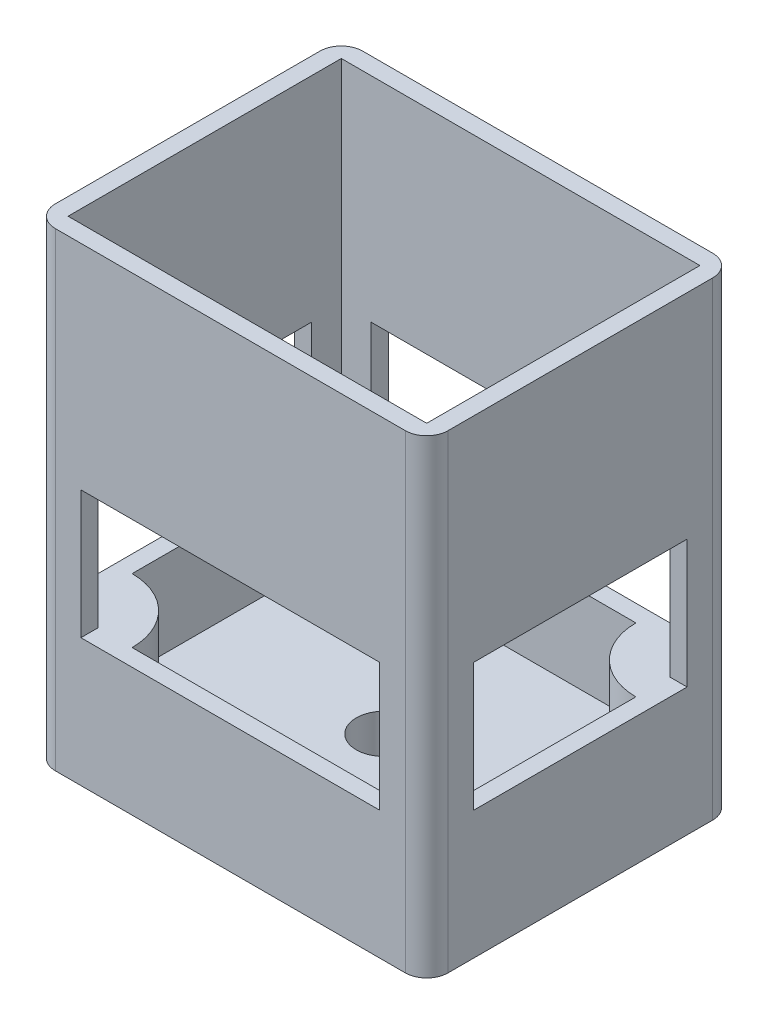
ISO-10303-21;
HEADER;
FILE_DESCRIPTION(('STEP AP214'),'2;1');
FILE_NAME('part.step','',(''),(''),'','','');
FILE_SCHEMA(('AUTOMOTIVE_DESIGN { 1 0 10303 214 1 1 1 1 }'));
ENDSEC;
DATA;
#1=APPLICATION_CONTEXT('core data for automotive mechanical design processes');
#2=APPLICATION_PROTOCOL_DEFINITION('international standard','automotive_design',2000,#1);
#3=PRODUCT_CONTEXT('',#1,'mechanical');
#4=PRODUCT('Part','Part','',(#3));
#5=PRODUCT_RELATED_PRODUCT_CATEGORY('part','',(#4));
#6=PRODUCT_DEFINITION_FORMATION('','',#4);
#7=PRODUCT_DEFINITION_CONTEXT('part definition',#1,'design');
#8=PRODUCT_DEFINITION('design','',#6,#7);
#9=PRODUCT_DEFINITION_SHAPE('','',#8);
#10=(LENGTH_UNIT() NAMED_UNIT(*) SI_UNIT(.MILLI.,.METRE.));
#11=(NAMED_UNIT(*) PLANE_ANGLE_UNIT() SI_UNIT($,.RADIAN.));
#12=(NAMED_UNIT(*) SI_UNIT($,.STERADIAN.) SOLID_ANGLE_UNIT());
#13=UNCERTAINTY_MEASURE_WITH_UNIT(LENGTH_MEASURE(1.E-05),#10,'distance_accuracy_value','');
#14=(GEOMETRIC_REPRESENTATION_CONTEXT(3) GLOBAL_UNCERTAINTY_ASSIGNED_CONTEXT((#13)) GLOBAL_UNIT_ASSIGNED_CONTEXT((#10,
#11,#12)) REPRESENTATION_CONTEXT('',''));
#15=CARTESIAN_POINT('',(0.,0.,0.));
#16=DIRECTION('',(0.,0.,1.));
#17=DIRECTION('',(1.,0.,0.));
#18=AXIS2_PLACEMENT_3D('',#15,#16,#17);
#19=CARTESIAN_POINT('',(21.,55.,-16.));
#20=DIRECTION('',(-1.,0.,0.));
#21=DIRECTION('',(0.,0.,1.));
#22=AXIS2_PLACEMENT_3D('',#19,#20,#21);
#23=PLANE('',#22);
#24=DIRECTION('',(0.,0.,-1.));
#25=VECTOR('',#24,1.);
#26=CARTESIAN_POINT('',(21.,15.,-8.5));
#27=LINE('',#26,#25);
#28=CARTESIAN_POINT('',(21.,15.,-12.5));
#29=VERTEX_POINT('',#28);
#30=CARTESIAN_POINT('',(21.,15.,-16.));
#31=VERTEX_POINT('',#30);
#32=EDGE_CURVE('E376',#29,#31,#27,.T.);
#33=ORIENTED_EDGE('',*,*,#32,.F.);
#34=DIRECTION('',(0.,1.,0.));
#35=VECTOR('',#34,1.);
#36=CARTESIAN_POINT('',(21.,55.,-12.5));
#37=LINE('',#36,#35);
#38=CARTESIAN_POINT('',(21.,30.,-12.5));
#39=VERTEX_POINT('',#38);
#40=EDGE_CURVE('E352',#29,#39,#37,.T.);
#41=ORIENTED_EDGE('',*,*,#40,.T.);
#42=DIRECTION('',(0.,0.,1.));
#43=VECTOR('',#42,1.);
#44=CARTESIAN_POINT('',(21.,30.,-16.));
#45=LINE('',#44,#43);
#46=CARTESIAN_POINT('',(21.,30.,12.5));
#47=VERTEX_POINT('',#46);
#48=EDGE_CURVE('E370',#39,#47,#45,.T.);
#49=ORIENTED_EDGE('',*,*,#48,.T.);
#50=DIRECTION('',(0.,-1.,0.));
#51=VECTOR('',#50,1.);
#52=CARTESIAN_POINT('',(21.,55.,12.5));
#53=LINE('',#52,#51);
#54=CARTESIAN_POINT('',(21.,15.,12.5));
#55=VERTEX_POINT('',#54);
#56=EDGE_CURVE('E364',#47,#55,#53,.T.);
#57=ORIENTED_EDGE('',*,*,#56,.T.);
#58=DIRECTION('',(0.,0.,-1.));
#59=VECTOR('',#58,1.);
#60=CARTESIAN_POINT('',(21.,15.,-16.));
#61=LINE('',#60,#59);
#62=CARTESIAN_POINT('',(21.,15.,-8.5));
#63=VERTEX_POINT('',#62);
#64=EDGE_CURVE('E356',#55,#63,#61,.T.);
#65=ORIENTED_EDGE('',*,*,#64,.T.);
#66=DIRECTION('',(0.,-1.,0.));
#67=VECTOR('',#66,1.);
#68=CARTESIAN_POINT('',(21.,15.,-8.5));
#69=LINE('',#68,#67);
#70=CARTESIAN_POINT('',(21.,5.,-8.5));
#71=VERTEX_POINT('',#70);
#72=EDGE_CURVE('E385',#63,#71,#69,.T.);
#73=ORIENTED_EDGE('',*,*,#72,.T.);
#74=DIRECTION('',(0.,0.,1.));
#75=VECTOR('',#74,1.);
#76=CARTESIAN_POINT('',(21.,5.,-16.));
#77=LINE('',#76,#75);
#78=CARTESIAN_POINT('',(21.,5.,16.));
#79=VERTEX_POINT('',#78);
#80=EDGE_CURVE('E406',#71,#79,#77,.T.);
#81=ORIENTED_EDGE('',*,*,#80,.T.);
#82=DIRECTION('',(0.,-1.,0.));
#83=VECTOR('',#82,1.);
#84=CARTESIAN_POINT('',(21.,55.,16.));
#85=LINE('',#84,#83);
#86=CARTESIAN_POINT('',(21.,55.,16.));
#87=VERTEX_POINT('',#86);
#88=EDGE_CURVE('E428',#87,#79,#85,.T.);
#89=ORIENTED_EDGE('',*,*,#88,.F.);
#90=DIRECTION('',(0.,0.,-1.));
#91=VECTOR('',#90,1.);
#92=CARTESIAN_POINT('',(21.,55.,-16.));
#93=LINE('',#92,#91);
#94=CARTESIAN_POINT('',(21.,55.,-16.));
#95=VERTEX_POINT('',#94);
#96=EDGE_CURVE('E417',#87,#95,#93,.T.);
#97=ORIENTED_EDGE('',*,*,#96,.T.);
#98=DIRECTION('',(0.,-1.,0.));
#99=VECTOR('',#98,1.);
#100=CARTESIAN_POINT('',(21.,55.,-16.));
#101=LINE('',#100,#99);
#102=EDGE_CURVE('E425',#95,#31,#101,.T.);
#103=ORIENTED_EDGE('',*,*,#102,.T.);
#104=EDGE_LOOP('',(#33,#41,#49,#57,#65,#73,#81,#89,#97,#103));
#105=FACE_BOUND('',#104,.T.);
#106=ADVANCED_FACE('F40',(#105),#23,.T.);
#107=CARTESIAN_POINT('',(-21.,55.,-16.));
#108=DIRECTION('',(1.,0.,0.));
#109=DIRECTION('',(0.,0.,-1.));
#110=AXIS2_PLACEMENT_3D('',#107,#108,#109);
#111=PLANE('',#110);
#112=DIRECTION('',(0.,-1.,0.));
#113=VECTOR('',#112,1.);
#114=CARTESIAN_POINT('',(-21.,55.,-12.5));
#115=LINE('',#114,#113);
#116=CARTESIAN_POINT('',(-21.,30.,-12.5));
#117=VERTEX_POINT('',#116);
#118=CARTESIAN_POINT('',(-21.,15.,-12.5));
#119=VERTEX_POINT('',#118);
#120=EDGE_CURVE('E349',#117,#119,#115,.T.);
#121=ORIENTED_EDGE('',*,*,#120,.T.);
#122=DIRECTION('',(0.,0.,1.));
#123=VECTOR('',#122,1.);
#124=CARTESIAN_POINT('',(-21.,15.,-16.));
#125=LINE('',#124,#123);
#126=CARTESIAN_POINT('',(-21.,15.,8.5));
#127=VERTEX_POINT('',#126);
#128=EDGE_CURVE('E355',#119,#127,#125,.T.);
#129=ORIENTED_EDGE('',*,*,#128,.T.);
#130=DIRECTION('',(0.,-1.,0.));
#131=VECTOR('',#130,1.);
#132=CARTESIAN_POINT('',(-21.,15.,8.5));
#133=LINE('',#132,#131);
#134=CARTESIAN_POINT('',(-21.,5.,8.5));
#135=VERTEX_POINT('',#134);
#136=EDGE_CURVE('E400',#127,#135,#133,.T.);
#137=ORIENTED_EDGE('',*,*,#136,.T.);
#138=DIRECTION('',(0.,0.,-1.));
#139=VECTOR('',#138,1.);
#140=CARTESIAN_POINT('',(-21.,5.,16.));
#141=LINE('',#140,#139);
#142=CARTESIAN_POINT('',(-21.,5.,-16.));
#143=VERTEX_POINT('',#142);
#144=EDGE_CURVE('E411',#135,#143,#141,.T.);
#145=ORIENTED_EDGE('',*,*,#144,.T.);
#146=DIRECTION('',(0.,-1.,0.));
#147=VECTOR('',#146,1.);
#148=CARTESIAN_POINT('',(-21.,55.,-16.));
#149=LINE('',#148,#147);
#150=CARTESIAN_POINT('',(-21.,55.,-16.));
#151=VERTEX_POINT('',#150);
#152=EDGE_CURVE('E422',#151,#143,#149,.T.);
#153=ORIENTED_EDGE('',*,*,#152,.F.);
#154=DIRECTION('',(0.,0.,1.));
#155=VECTOR('',#154,1.);
#156=CARTESIAN_POINT('',(-21.,55.,-16.));
#157=LINE('',#156,#155);
#158=CARTESIAN_POINT('',(-21.,55.,16.));
#159=VERTEX_POINT('',#158);
#160=EDGE_CURVE('E413',#151,#159,#157,.T.);
#161=ORIENTED_EDGE('',*,*,#160,.T.);
#162=DIRECTION('',(0.,-1.,0.));
#163=VECTOR('',#162,1.);
#164=CARTESIAN_POINT('',(-21.,55.,16.));
#165=LINE('',#164,#163);
#166=CARTESIAN_POINT('',(-21.,15.,16.));
#167=VERTEX_POINT('',#166);
#168=EDGE_CURVE('E431',#159,#167,#165,.T.);
#169=ORIENTED_EDGE('',*,*,#168,.T.);
#170=DIRECTION('',(0.,0.,1.));
#171=VECTOR('',#170,1.);
#172=CARTESIAN_POINT('',(-21.,15.,8.5));
#173=LINE('',#172,#171);
#174=CARTESIAN_POINT('',(-21.,15.,12.5));
#175=VERTEX_POINT('',#174);
#176=EDGE_CURVE('E390',#175,#167,#173,.T.);
#177=ORIENTED_EDGE('',*,*,#176,.F.);
#178=DIRECTION('',(0.,1.,0.));
#179=VECTOR('',#178,1.);
#180=CARTESIAN_POINT('',(-21.,55.,12.5));
#181=LINE('',#180,#179);
#182=CARTESIAN_POINT('',(-21.,30.,12.5));
#183=VERTEX_POINT('',#182);
#184=EDGE_CURVE('E359',#175,#183,#181,.T.);
#185=ORIENTED_EDGE('',*,*,#184,.T.);
#186=DIRECTION('',(0.,0.,-1.));
#187=VECTOR('',#186,1.);
#188=CARTESIAN_POINT('',(-21.,30.,-16.));
#189=LINE('',#188,#187);
#190=EDGE_CURVE('E367',#183,#117,#189,.T.);
#191=ORIENTED_EDGE('',*,*,#190,.T.);
#192=EDGE_LOOP('',(#121,#129,#137,#145,#153,#161,#169,#177,#185,#191));
#193=FACE_BOUND('',#192,.T.);
#194=ADVANCED_FACE('F539',(#193),#111,.T.);
#195=CARTESIAN_POINT('',(-23.,55.,-18.));
#196=DIRECTION('',(1.,0.,0.));
#197=DIRECTION('',(0.,0.,-1.));
#198=AXIS2_PLACEMENT_3D('',#195,#196,#197);
#199=PLANE('',#198);
#200=DIRECTION('',(0.,0.,1.));
#201=VECTOR('',#200,1.);
#202=CARTESIAN_POINT('',(-23.,55.,-18.));
#203=LINE('',#202,#201);
#204=CARTESIAN_POINT('',(-23.,55.,-15.5));
#205=VERTEX_POINT('',#204);
#206=CARTESIAN_POINT('',(-23.,55.,15.5));
#207=VERTEX_POINT('',#206);
#208=EDGE_CURVE('E435',#205,#207,#203,.T.);
#209=ORIENTED_EDGE('',*,*,#208,.F.);
#210=DIRECTION('',(0.,-1.,0.));
#211=VECTOR('',#210,1.);
#212=CARTESIAN_POINT('',(-23.,55.,-15.5));
#213=LINE('',#212,#211);
#214=CARTESIAN_POINT('',(-23.,0.,-15.5));
#215=VERTEX_POINT('',#214);
#216=EDGE_CURVE('E460',#205,#215,#213,.T.);
#217=ORIENTED_EDGE('',*,*,#216,.T.);
#218=DIRECTION('',(0.,0.,1.));
#219=VECTOR('',#218,1.);
#220=CARTESIAN_POINT('',(-23.,0.,-18.));
#221=LINE('',#220,#219);
#222=CARTESIAN_POINT('',(-23.,0.,15.5));
#223=VERTEX_POINT('',#222);
#224=EDGE_CURVE('E434',#215,#223,#221,.T.);
#225=ORIENTED_EDGE('',*,*,#224,.T.);
#226=DIRECTION('',(0.,-1.,0.));
#227=VECTOR('',#226,1.);
#228=CARTESIAN_POINT('',(-23.,55.,15.5));
#229=LINE('',#228,#227);
#230=EDGE_CURVE('E448',#223,#207,#229,.F.);
#231=ORIENTED_EDGE('',*,*,#230,.T.);
#232=EDGE_LOOP('',(#209,#217,#225,#231));
#233=FACE_BOUND('',#232,.T.);
#234=DIRECTION('',(0.,-1.,0.));
#235=VECTOR('',#234,1.);
#236=CARTESIAN_POINT('',(-23.,30.,-12.5));
#237=LINE('',#236,#235);
#238=CARTESIAN_POINT('',(-23.,30.,-12.5));
#239=VERTEX_POINT('',#238);
#240=CARTESIAN_POINT('',(-23.,15.,-12.5));
#241=VERTEX_POINT('',#240);
#242=EDGE_CURVE('E314',#239,#241,#237,.T.);
#243=ORIENTED_EDGE('',*,*,#242,.F.);
#244=DIRECTION('',(0.,0.,-1.));
#245=VECTOR('',#244,1.);
#246=CARTESIAN_POINT('',(-23.,30.,-12.5));
#247=LINE('',#246,#245);
#248=CARTESIAN_POINT('',(-23.,30.,12.5));
#249=VERTEX_POINT('',#248);
#250=EDGE_CURVE('E322',#249,#239,#247,.T.);
#251=ORIENTED_EDGE('',*,*,#250,.F.);
#252=DIRECTION('',(0.,1.,0.));
#253=VECTOR('',#252,1.);
#254=CARTESIAN_POINT('',(-23.,30.,12.5));
#255=LINE('',#254,#253);
#256=CARTESIAN_POINT('',(-23.,15.,12.5));
#257=VERTEX_POINT('',#256);
#258=EDGE_CURVE('E319',#257,#249,#255,.T.);
#259=ORIENTED_EDGE('',*,*,#258,.F.);
#260=DIRECTION('',(0.,0.,1.));
#261=VECTOR('',#260,1.);
#262=CARTESIAN_POINT('',(-23.,15.,-12.5));
#263=LINE('',#262,#261);
#264=EDGE_CURVE('E316',#241,#257,#263,.T.);
#265=ORIENTED_EDGE('',*,*,#264,.F.);
#266=EDGE_LOOP('',(#243,#251,#259,#265));
#267=FACE_BOUND('',#266,.T.);
#268=ADVANCED_FACE('F526',(#233,#267),#199,.F.);
#269=CARTESIAN_POINT('',(23.,55.,-18.));
#270=DIRECTION('',(-1.,0.,0.));
#271=DIRECTION('',(0.,0.,1.));
#272=AXIS2_PLACEMENT_3D('',#269,#270,#271);
#273=PLANE('',#272);
#274=DIRECTION('',(0.,0.,-1.));
#275=VECTOR('',#274,1.);
#276=CARTESIAN_POINT('',(23.,0.,-18.));
#277=LINE('',#276,#275);
#278=CARTESIAN_POINT('',(23.,0.,15.5));
#279=VERTEX_POINT('',#278);
#280=CARTESIAN_POINT('',(23.,0.,-15.5));
#281=VERTEX_POINT('',#280);
#282=EDGE_CURVE('E454',#279,#281,#277,.T.);
#283=ORIENTED_EDGE('',*,*,#282,.T.);
#284=DIRECTION('',(0.,-1.,0.));
#285=VECTOR('',#284,1.);
#286=CARTESIAN_POINT('',(23.,55.,-15.5));
#287=LINE('',#286,#285);
#288=CARTESIAN_POINT('',(23.,55.,-15.5));
#289=VERTEX_POINT('',#288);
#290=EDGE_CURVE('E487',#281,#289,#287,.F.);
#291=ORIENTED_EDGE('',*,*,#290,.T.);
#292=DIRECTION('',(0.,0.,-1.));
#293=VECTOR('',#292,1.);
#294=CARTESIAN_POINT('',(23.,55.,-18.));
#295=LINE('',#294,#293);
#296=CARTESIAN_POINT('',(23.,55.,15.5));
#297=VERTEX_POINT('',#296);
#298=EDGE_CURVE('E442',#297,#289,#295,.T.);
#299=ORIENTED_EDGE('',*,*,#298,.F.);
#300=DIRECTION('',(0.,-1.,0.));
#301=VECTOR('',#300,1.);
#302=CARTESIAN_POINT('',(23.,55.,15.5));
#303=LINE('',#302,#301);
#304=EDGE_CURVE('E484',#297,#279,#303,.T.);
#305=ORIENTED_EDGE('',*,*,#304,.T.);
#306=EDGE_LOOP('',(#283,#291,#299,#305));
#307=FACE_BOUND('',#306,.T.);
#308=DIRECTION('',(0.,-1.,0.));
#309=VECTOR('',#308,1.);
#310=CARTESIAN_POINT('',(23.,30.,-12.5));
#311=LINE('',#310,#309);
#312=CARTESIAN_POINT('',(23.,30.,-12.5));
#313=VERTEX_POINT('',#312);
#314=CARTESIAN_POINT('',(23.,15.,-12.5));
#315=VERTEX_POINT('',#314);
#316=EDGE_CURVE('E313',#313,#315,#311,.T.);
#317=ORIENTED_EDGE('',*,*,#316,.T.);
#318=DIRECTION('',(0.,0.,1.));
#319=VECTOR('',#318,1.);
#320=CARTESIAN_POINT('',(23.,15.,-12.5));
#321=LINE('',#320,#319);
#322=CARTESIAN_POINT('',(23.,15.,12.5));
#323=VERTEX_POINT('',#322);
#324=EDGE_CURVE('E327',#315,#323,#321,.T.);
#325=ORIENTED_EDGE('',*,*,#324,.T.);
#326=DIRECTION('',(0.,1.,0.));
#327=VECTOR('',#326,1.);
#328=CARTESIAN_POINT('',(23.,30.,12.5));
#329=LINE('',#328,#327);
#330=CARTESIAN_POINT('',(23.,30.,12.5));
#331=VERTEX_POINT('',#330);
#332=EDGE_CURVE('E330',#323,#331,#329,.T.);
#333=ORIENTED_EDGE('',*,*,#332,.T.);
#334=DIRECTION('',(0.,0.,-1.));
#335=VECTOR('',#334,1.);
#336=CARTESIAN_POINT('',(23.,30.,-12.5));
#337=LINE('',#336,#335);
#338=EDGE_CURVE('E317',#331,#313,#337,.T.);
#339=ORIENTED_EDGE('',*,*,#338,.T.);
#340=EDGE_LOOP('',(#317,#325,#333,#339));
#341=FACE_BOUND('',#340,.T.);
#342=ADVANCED_FACE('F507',(#307,#341),#273,.F.);
#343=CARTESIAN_POINT('',(0.,5.,0.));
#344=DIRECTION('',(0.,-1.,0.));
#345=DIRECTION('',(0.,0.,-1.));
#346=AXIS2_PLACEMENT_3D('',#343,#344,#345);
#347=PLANE('',#346);
#348=CARTESIAN_POINT('',(0.,5.,0.));
#349=DIRECTION('',(0.,1.,0.));
#350=DIRECTION('',(0.,0.,1.));
#351=AXIS2_PLACEMENT_3D('',#348,#349,#350);
#352=CIRCLE('',#351,3.25);
#353=CARTESIAN_POINT('',(0.,5.,3.25));
#354=VERTEX_POINT('',#353);
#355=EDGE_CURVE('E814',#354,#354,#352,.T.);
#356=ORIENTED_EDGE('',*,*,#355,.F.);
#357=EDGE_LOOP('',(#356));
#358=FACE_BOUND('',#357,.T.);
#359=CARTESIAN_POINT('',(21.,5.,-16.));
#360=DIRECTION('',(0.,1.,0.));
#361=DIRECTION('',(0.,0.,1.));
#362=AXIS2_PLACEMENT_3D('',#359,#360,#361);
#363=CIRCLE('',#362,7.5);
#364=CARTESIAN_POINT('',(13.5,5.,-16.));
#365=VERTEX_POINT('',#364);
#366=EDGE_CURVE('E373',#365,#71,#363,.T.);
#367=ORIENTED_EDGE('',*,*,#366,.F.);
#368=DIRECTION('',(1.,0.,0.));
#369=VECTOR('',#368,1.);
#370=CARTESIAN_POINT('',(-21.,5.,-16.));
#371=LINE('',#370,#369);
#372=EDGE_CURVE('E403',#143,#365,#371,.T.);
#373=ORIENTED_EDGE('',*,*,#372,.F.);
#374=ORIENTED_EDGE('',*,*,#144,.F.);
#375=CARTESIAN_POINT('',(-21.,5.,16.));
#376=DIRECTION('',(0.,1.,0.));
#377=DIRECTION('',(0.,0.,1.));
#378=AXIS2_PLACEMENT_3D('',#375,#376,#377);
#379=CIRCLE('',#378,7.5);
#380=CARTESIAN_POINT('',(-13.5,5.,16.));
#381=VERTEX_POINT('',#380);
#382=EDGE_CURVE('E387',#381,#135,#379,.T.);
#383=ORIENTED_EDGE('',*,*,#382,.F.);
#384=DIRECTION('',(-1.,0.,0.));
#385=VECTOR('',#384,1.);
#386=CARTESIAN_POINT('',(21.,5.,16.));
#387=LINE('',#386,#385);
#388=EDGE_CURVE('E408',#79,#381,#387,.T.);
#389=ORIENTED_EDGE('',*,*,#388,.F.);
#390=ORIENTED_EDGE('',*,*,#80,.F.);
#391=EDGE_LOOP('',(#367,#373,#374,#383,#389,#390));
#392=FACE_BOUND('',#391,.T.);
#393=ADVANCED_FACE('F565',(#358,#392),#347,.F.);
#394=CARTESIAN_POINT('',(-21.,55.,-16.));
#395=DIRECTION('',(0.,0.,1.));
#396=DIRECTION('',(1.,0.,0.));
#397=AXIS2_PLACEMENT_3D('',#394,#395,#396);
#398=PLANE('',#397);
#399=DIRECTION('',(0.,1.,0.));
#400=VECTOR('',#399,1.);
#401=CARTESIAN_POINT('',(17.5,55.,-16.));
#402=LINE('',#401,#400);
#403=CARTESIAN_POINT('',(17.5,15.,-16.));
#404=VERTEX_POINT('',#403);
#405=CARTESIAN_POINT('',(17.5,30.,-16.));
#406=VERTEX_POINT('',#405);
#407=EDGE_CURVE('E300',#404,#406,#402,.T.);
#408=ORIENTED_EDGE('',*,*,#407,.F.);
#409=DIRECTION('',(-1.,0.,0.));
#410=VECTOR('',#409,1.);
#411=CARTESIAN_POINT('',(21.,15.,-16.));
#412=LINE('',#411,#410);
#413=EDGE_CURVE('E378',#31,#404,#412,.T.);
#414=ORIENTED_EDGE('',*,*,#413,.F.);
#415=ORIENTED_EDGE('',*,*,#102,.F.);
#416=DIRECTION('',(-1.,0.,0.));
#417=VECTOR('',#416,1.);
#418=CARTESIAN_POINT('',(-21.,55.,-16.));
#419=LINE('',#418,#417);
#420=EDGE_CURVE('E420',#95,#151,#419,.T.);
#421=ORIENTED_EDGE('',*,*,#420,.T.);
#422=ORIENTED_EDGE('',*,*,#152,.T.);
#423=ORIENTED_EDGE('',*,*,#372,.T.);
#424=DIRECTION('',(0.,-1.,0.));
#425=VECTOR('',#424,1.);
#426=CARTESIAN_POINT('',(13.5,15.,-16.));
#427=LINE('',#426,#425);
#428=CARTESIAN_POINT('',(13.5,15.,-16.));
#429=VERTEX_POINT('',#428);
#430=EDGE_CURVE('E380',#429,#365,#427,.T.);
#431=ORIENTED_EDGE('',*,*,#430,.F.);
#432=DIRECTION('',(1.,0.,0.));
#433=VECTOR('',#432,1.);
#434=CARTESIAN_POINT('',(-21.,15.,-16.));
#435=LINE('',#434,#433);
#436=CARTESIAN_POINT('',(-17.5,15.,-16.));
#437=VERTEX_POINT('',#436);
#438=EDGE_CURVE('E303',#437,#429,#435,.T.);
#439=ORIENTED_EDGE('',*,*,#438,.F.);
#440=DIRECTION('',(0.,-1.,0.));
#441=VECTOR('',#440,1.);
#442=CARTESIAN_POINT('',(-17.5,55.,-16.));
#443=LINE('',#442,#441);
#444=CARTESIAN_POINT('',(-17.5,30.,-16.));
#445=VERTEX_POINT('',#444);
#446=EDGE_CURVE('E256',#445,#437,#443,.T.);
#447=ORIENTED_EDGE('',*,*,#446,.F.);
#448=DIRECTION('',(-1.,0.,0.));
#449=VECTOR('',#448,1.);
#450=CARTESIAN_POINT('',(-21.,30.,-16.));
#451=LINE('',#450,#449);
#452=EDGE_CURVE('E311',#406,#445,#451,.T.);
#453=ORIENTED_EDGE('',*,*,#452,.F.);
#454=EDGE_LOOP('',(#408,#414,#415,#421,#422,#423,#431,#439,#447,#453));
#455=FACE_BOUND('',#454,.T.);
#456=ADVANCED_FACE('F550',(#455),#398,.T.);
#457=CARTESIAN_POINT('',(-21.,55.,16.));
#458=DIRECTION('',(0.,0.,-1.));
#459=DIRECTION('',(-1.,0.,0.));
#460=AXIS2_PLACEMENT_3D('',#457,#458,#459);
#461=PLANE('',#460);
#462=DIRECTION('',(0.,1.,0.));
#463=VECTOR('',#462,1.);
#464=CARTESIAN_POINT('',(-17.5,55.,16.));
#465=LINE('',#464,#463);
#466=CARTESIAN_POINT('',(-17.5,15.,16.));
#467=VERTEX_POINT('',#466);
#468=CARTESIAN_POINT('',(-17.5,30.,16.));
#469=VERTEX_POINT('',#468);
#470=EDGE_CURVE('E305',#467,#469,#465,.T.);
#471=ORIENTED_EDGE('',*,*,#470,.F.);
#472=DIRECTION('',(1.,0.,0.));
#473=VECTOR('',#472,1.);
#474=CARTESIAN_POINT('',(-21.,15.,16.));
#475=LINE('',#474,#473);
#476=EDGE_CURVE('E392',#167,#467,#475,.T.);
#477=ORIENTED_EDGE('',*,*,#476,.F.);
#478=ORIENTED_EDGE('',*,*,#168,.F.);
#479=DIRECTION('',(1.,0.,0.));
#480=VECTOR('',#479,1.);
#481=CARTESIAN_POINT('',(-21.,55.,16.));
#482=LINE('',#481,#480);
#483=EDGE_CURVE('E415',#159,#87,#482,.T.);
#484=ORIENTED_EDGE('',*,*,#483,.T.);
#485=ORIENTED_EDGE('',*,*,#88,.T.);
#486=ORIENTED_EDGE('',*,*,#388,.T.);
#487=DIRECTION('',(0.,-1.,0.));
#488=VECTOR('',#487,1.);
#489=CARTESIAN_POINT('',(-13.5,15.,16.));
#490=LINE('',#489,#488);
#491=CARTESIAN_POINT('',(-13.5,15.,16.));
#492=VERTEX_POINT('',#491);
#493=EDGE_CURVE('E395',#492,#381,#490,.T.);
#494=ORIENTED_EDGE('',*,*,#493,.F.);
#495=DIRECTION('',(-1.,0.,0.));
#496=VECTOR('',#495,1.);
#497=CARTESIAN_POINT('',(-21.,15.,16.));
#498=LINE('',#497,#496);
#499=CARTESIAN_POINT('',(17.5,15.,16.));
#500=VERTEX_POINT('',#499);
#501=EDGE_CURVE('E302',#500,#492,#498,.T.);
#502=ORIENTED_EDGE('',*,*,#501,.F.);
#503=DIRECTION('',(0.,-1.,0.));
#504=VECTOR('',#503,1.);
#505=CARTESIAN_POINT('',(17.5,55.,16.));
#506=LINE('',#505,#504);
#507=CARTESIAN_POINT('',(17.5,30.,16.));
#508=VERTEX_POINT('',#507);
#509=EDGE_CURVE('E292',#508,#500,#506,.T.);
#510=ORIENTED_EDGE('',*,*,#509,.F.);
#511=DIRECTION('',(1.,0.,0.));
#512=VECTOR('',#511,1.);
#513=CARTESIAN_POINT('',(-21.,30.,16.));
#514=LINE('',#513,#512);
#515=EDGE_CURVE('E309',#469,#508,#514,.T.);
#516=ORIENTED_EDGE('',*,*,#515,.F.);
#517=EDGE_LOOP('',(#471,#477,#478,#484,#485,#486,#494,#502,#510,#516));
#518=FACE_BOUND('',#517,.T.);
#519=ADVANCED_FACE('F552',(#518),#461,.T.);
#520=CARTESIAN_POINT('',(0.,55.,0.));
#521=DIRECTION('',(0.,1.,0.));
#522=DIRECTION('',(0.,0.,1.));
#523=AXIS2_PLACEMENT_3D('',#520,#521,#522);
#524=PLANE('',#523);
#525=DIRECTION('',(-1.,0.,0.));
#526=VECTOR('',#525,1.);
#527=CARTESIAN_POINT('',(-23.,55.,-18.));
#528=LINE('',#527,#526);
#529=CARTESIAN_POINT('',(20.5,55.,-18.));
#530=VERTEX_POINT('',#529);
#531=CARTESIAN_POINT('',(-20.5,55.,-18.));
#532=VERTEX_POINT('',#531);
#533=EDGE_CURVE('E445',#530,#532,#528,.T.);
#534=ORIENTED_EDGE('',*,*,#533,.T.);
#535=CARTESIAN_POINT('',(-20.5,55.,-15.5));
#536=DIRECTION('',(0.,1.,0.));
#537=DIRECTION('',(0.,0.,1.));
#538=AXIS2_PLACEMENT_3D('',#535,#536,#537);
#539=CIRCLE('',#538,2.5);
#540=EDGE_CURVE('E482',#532,#205,#539,.T.);
#541=ORIENTED_EDGE('',*,*,#540,.T.);
#542=ORIENTED_EDGE('',*,*,#208,.T.);
#543=CARTESIAN_POINT('',(-20.5,55.,15.5));
#544=DIRECTION('',(0.,1.,0.));
#545=DIRECTION('',(0.,0.,1.));
#546=AXIS2_PLACEMENT_3D('',#543,#544,#545);
#547=CIRCLE('',#546,2.5);
#548=CARTESIAN_POINT('',(-20.5,55.,18.));
#549=VERTEX_POINT('',#548);
#550=EDGE_CURVE('E476',#207,#549,#547,.T.);
#551=ORIENTED_EDGE('',*,*,#550,.T.);
#552=DIRECTION('',(1.,0.,0.));
#553=VECTOR('',#552,1.);
#554=CARTESIAN_POINT('',(-23.,55.,18.));
#555=LINE('',#554,#553);
#556=CARTESIAN_POINT('',(20.5,55.,18.));
#557=VERTEX_POINT('',#556);
#558=EDGE_CURVE('E438',#549,#557,#555,.T.);
#559=ORIENTED_EDGE('',*,*,#558,.T.);
#560=CARTESIAN_POINT('',(20.5,55.,15.5));
#561=DIRECTION('',(0.,1.,0.));
#562=DIRECTION('',(0.,0.,1.));
#563=AXIS2_PLACEMENT_3D('',#560,#561,#562);
#564=CIRCLE('',#563,2.5);
#565=EDGE_CURVE('E478',#557,#297,#564,.T.);
#566=ORIENTED_EDGE('',*,*,#565,.T.);
#567=ORIENTED_EDGE('',*,*,#298,.T.);
#568=CARTESIAN_POINT('',(20.5,55.,-15.5));
#569=DIRECTION('',(0.,1.,0.));
#570=DIRECTION('',(0.,0.,1.));
#571=AXIS2_PLACEMENT_3D('',#568,#569,#570);
#572=CIRCLE('',#571,2.5);
#573=EDGE_CURVE('E480',#289,#530,#572,.T.);
#574=ORIENTED_EDGE('',*,*,#573,.T.);
#575=EDGE_LOOP('',(#534,#541,#542,#551,#559,#566,#567,#574));
#576=FACE_BOUND('',#575,.T.);
#577=ORIENTED_EDGE('',*,*,#483,.F.);
#578=ORIENTED_EDGE('',*,*,#160,.F.);
#579=ORIENTED_EDGE('',*,*,#420,.F.);
#580=ORIENTED_EDGE('',*,*,#96,.F.);
#581=EDGE_LOOP('',(#577,#578,#579,#580));
#582=FACE_BOUND('',#581,.T.);
#583=ADVANCED_FACE('F512',(#576,#582),#524,.T.);
#584=CARTESIAN_POINT('',(0.,0.,0.));
#585=DIRECTION('',(0.,1.,0.));
#586=DIRECTION('',(0.,0.,1.));
#587=AXIS2_PLACEMENT_3D('',#584,#585,#586);
#588=PLANE('',#587);
#589=CARTESIAN_POINT('',(0.,0.,0.));
#590=DIRECTION('',(0.,1.,0.));
#591=DIRECTION('',(0.,0.,1.));
#592=AXIS2_PLACEMENT_3D('',#589,#590,#591);
#593=CIRCLE('',#592,3.25);
#594=CARTESIAN_POINT('',(0.,0.,3.25));
#595=VERTEX_POINT('',#594);
#596=EDGE_CURVE('E279',#595,#595,#593,.F.);
#597=ORIENTED_EDGE('',*,*,#596,.F.);
#598=EDGE_LOOP('',(#597));
#599=FACE_BOUND('',#598,.T.);
#600=ORIENTED_EDGE('',*,*,#224,.F.);
#601=CARTESIAN_POINT('',(-20.5,0.,-15.5));
#602=DIRECTION('',(0.,1.,0.));
#603=DIRECTION('',(0.,0.,1.));
#604=AXIS2_PLACEMENT_3D('',#601,#602,#603);
#605=CIRCLE('',#604,2.5);
#606=CARTESIAN_POINT('',(-20.5,0.,-18.));
#607=VERTEX_POINT('',#606);
#608=EDGE_CURVE('E469',#215,#607,#605,.F.);
#609=ORIENTED_EDGE('',*,*,#608,.T.);
#610=DIRECTION('',(-1.,0.,0.));
#611=VECTOR('',#610,1.);
#612=CARTESIAN_POINT('',(-23.,0.,-18.));
#613=LINE('',#612,#611);
#614=CARTESIAN_POINT('',(20.5,0.,-18.));
#615=VERTEX_POINT('',#614);
#616=EDGE_CURVE('E439',#615,#607,#613,.T.);
#617=ORIENTED_EDGE('',*,*,#616,.F.);
#618=CARTESIAN_POINT('',(20.5,0.,-15.5));
#619=DIRECTION('',(0.,1.,0.));
#620=DIRECTION('',(0.,0.,1.));
#621=AXIS2_PLACEMENT_3D('',#618,#619,#620);
#622=CIRCLE('',#621,2.5);
#623=EDGE_CURVE('E467',#615,#281,#622,.F.);
#624=ORIENTED_EDGE('',*,*,#623,.T.);
#625=ORIENTED_EDGE('',*,*,#282,.F.);
#626=CARTESIAN_POINT('',(20.5,0.,15.5));
#627=DIRECTION('',(0.,1.,0.));
#628=DIRECTION('',(0.,0.,1.));
#629=AXIS2_PLACEMENT_3D('',#626,#627,#628);
#630=CIRCLE('',#629,2.5);
#631=CARTESIAN_POINT('',(20.5,0.,18.));
#632=VERTEX_POINT('',#631);
#633=EDGE_CURVE('E465',#279,#632,#630,.F.);
#634=ORIENTED_EDGE('',*,*,#633,.T.);
#635=DIRECTION('',(1.,0.,0.));
#636=VECTOR('',#635,1.);
#637=CARTESIAN_POINT('',(-23.,0.,18.));
#638=LINE('',#637,#636);
#639=CARTESIAN_POINT('',(-20.5,0.,18.));
#640=VERTEX_POINT('',#639);
#641=EDGE_CURVE('E451',#640,#632,#638,.T.);
#642=ORIENTED_EDGE('',*,*,#641,.F.);
#643=CARTESIAN_POINT('',(-20.5,0.,15.5));
#644=DIRECTION('',(0.,1.,0.));
#645=DIRECTION('',(0.,0.,1.));
#646=AXIS2_PLACEMENT_3D('',#643,#644,#645);
#647=CIRCLE('',#646,2.5);
#648=EDGE_CURVE('E463',#640,#223,#647,.F.);
#649=ORIENTED_EDGE('',*,*,#648,.T.);
#650=EDGE_LOOP('',(#600,#609,#617,#624,#625,#634,#642,#649));
#651=FACE_BOUND('',#650,.T.);
#652=ADVANCED_FACE('F499',(#599,#651),#588,.F.);
#653=CARTESIAN_POINT('',(-23.,55.,18.));
#654=DIRECTION('',(0.,0.,-1.));
#655=DIRECTION('',(-1.,0.,0.));
#656=AXIS2_PLACEMENT_3D('',#653,#654,#655);
#657=PLANE('',#656);
#658=DIRECTION('',(1.,0.,0.));
#659=VECTOR('',#658,1.);
#660=CARTESIAN_POINT('',(-17.5,15.,18.));
#661=LINE('',#660,#659);
#662=CARTESIAN_POINT('',(-17.5,15.,18.));
#663=VERTEX_POINT('',#662);
#664=CARTESIAN_POINT('',(17.5,15.,18.));
#665=VERTEX_POINT('',#664);
#666=EDGE_CURVE('E285',#663,#665,#661,.T.);
#667=ORIENTED_EDGE('',*,*,#666,.F.);
#668=DIRECTION('',(0.,-1.,0.));
#669=VECTOR('',#668,1.);
#670=CARTESIAN_POINT('',(-17.5,30.,18.));
#671=LINE('',#670,#669);
#672=CARTESIAN_POINT('',(-17.5,30.,18.));
#673=VERTEX_POINT('',#672);
#674=EDGE_CURVE('E55',#673,#663,#671,.T.);
#675=ORIENTED_EDGE('',*,*,#674,.F.);
#676=DIRECTION('',(-1.,0.,0.));
#677=VECTOR('',#676,1.);
#678=CARTESIAN_POINT('',(-17.5,30.,18.));
#679=LINE('',#678,#677);
#680=CARTESIAN_POINT('',(17.5,30.,18.));
#681=VERTEX_POINT('',#680);
#682=EDGE_CURVE('E273',#681,#673,#679,.T.);
#683=ORIENTED_EDGE('',*,*,#682,.F.);
#684=DIRECTION('',(0.,1.,0.));
#685=VECTOR('',#684,1.);
#686=CARTESIAN_POINT('',(17.5,30.,18.));
#687=LINE('',#686,#685);
#688=EDGE_CURVE('E276',#665,#681,#687,.T.);
#689=ORIENTED_EDGE('',*,*,#688,.F.);
#690=EDGE_LOOP('',(#667,#675,#683,#689));
#691=FACE_BOUND('',#690,.T.);
#692=ORIENTED_EDGE('',*,*,#641,.T.);
#693=DIRECTION('',(0.,-1.,0.));
#694=VECTOR('',#693,1.);
#695=CARTESIAN_POINT('',(20.5,55.,18.));
#696=LINE('',#695,#694);
#697=EDGE_CURVE('E11',#632,#557,#696,.F.);
#698=ORIENTED_EDGE('',*,*,#697,.T.);
#699=ORIENTED_EDGE('',*,*,#558,.F.);
#700=DIRECTION('',(0.,-1.,0.));
#701=VECTOR('',#700,1.);
#702=CARTESIAN_POINT('',(-20.5,55.,18.));
#703=LINE('',#702,#701);
#704=EDGE_CURVE('E48',#549,#640,#703,.T.);
#705=ORIENTED_EDGE('',*,*,#704,.T.);
#706=EDGE_LOOP('',(#692,#698,#699,#705));
#707=FACE_BOUND('',#706,.T.);
#708=ADVANCED_FACE('F493',(#691,#707),#657,.F.);
#709=CARTESIAN_POINT('',(-23.,55.,-18.));
#710=DIRECTION('',(0.,0.,1.));
#711=DIRECTION('',(1.,0.,0.));
#712=AXIS2_PLACEMENT_3D('',#709,#710,#711);
#713=PLANE('',#712);
#714=DIRECTION('',(-1.,0.,0.));
#715=VECTOR('',#714,1.);
#716=CARTESIAN_POINT('',(-17.5,30.,-18.));
#717=LINE('',#716,#715);
#718=CARTESIAN_POINT('',(17.5,30.,-18.));
#719=VERTEX_POINT('',#718);
#720=CARTESIAN_POINT('',(-17.5,30.,-18.));
#721=VERTEX_POINT('',#720);
#722=EDGE_CURVE('E272',#719,#721,#717,.T.);
#723=ORIENTED_EDGE('',*,*,#722,.T.);
#724=DIRECTION('',(0.,-1.,0.));
#725=VECTOR('',#724,1.);
#726=CARTESIAN_POINT('',(-17.5,30.,-18.));
#727=LINE('',#726,#725);
#728=CARTESIAN_POINT('',(-17.5,15.,-18.));
#729=VERTEX_POINT('',#728);
#730=EDGE_CURVE('E253',#721,#729,#727,.T.);
#731=ORIENTED_EDGE('',*,*,#730,.T.);
#732=DIRECTION('',(1.,0.,0.));
#733=VECTOR('',#732,1.);
#734=CARTESIAN_POINT('',(-17.5,15.,-18.));
#735=LINE('',#734,#733);
#736=CARTESIAN_POINT('',(17.5,15.,-18.));
#737=VERTEX_POINT('',#736);
#738=EDGE_CURVE('E263',#729,#737,#735,.T.);
#739=ORIENTED_EDGE('',*,*,#738,.T.);
#740=DIRECTION('',(0.,1.,0.));
#741=VECTOR('',#740,1.);
#742=CARTESIAN_POINT('',(17.5,30.,-18.));
#743=LINE('',#742,#741);
#744=EDGE_CURVE('E63',#737,#719,#743,.T.);
#745=ORIENTED_EDGE('',*,*,#744,.T.);
#746=EDGE_LOOP('',(#723,#731,#739,#745));
#747=FACE_BOUND('',#746,.T.);
#748=ORIENTED_EDGE('',*,*,#616,.T.);
#749=DIRECTION('',(0.,-1.,0.));
#750=VECTOR('',#749,1.);
#751=CARTESIAN_POINT('',(-20.5,55.,-18.));
#752=LINE('',#751,#750);
#753=EDGE_CURVE('E474',#607,#532,#752,.F.);
#754=ORIENTED_EDGE('',*,*,#753,.T.);
#755=ORIENTED_EDGE('',*,*,#533,.F.);
#756=DIRECTION('',(0.,-1.,0.));
#757=VECTOR('',#756,1.);
#758=CARTESIAN_POINT('',(20.5,55.,-18.));
#759=LINE('',#758,#757);
#760=EDGE_CURVE('E471',#530,#615,#759,.T.);
#761=ORIENTED_EDGE('',*,*,#760,.T.);
#762=EDGE_LOOP('',(#748,#754,#755,#761));
#763=FACE_BOUND('',#762,.T.);
#764=ADVANCED_FACE('F269',(#747,#763),#713,.F.);
#765=CARTESIAN_POINT('',(-20.5,55.,-15.5));
#766=DIRECTION('',(0.,-1.,0.));
#767=DIRECTION('',(0.,0.,-1.));
#768=AXIS2_PLACEMENT_3D('',#765,#766,#767);
#769=CYLINDRICAL_SURFACE('',#768,2.5);
#770=ORIENTED_EDGE('',*,*,#540,.F.);
#771=ORIENTED_EDGE('',*,*,#753,.F.);
#772=ORIENTED_EDGE('',*,*,#608,.F.);
#773=ORIENTED_EDGE('',*,*,#216,.F.);
#774=EDGE_LOOP('',(#770,#771,#772,#773));
#775=FACE_BOUND('',#774,.T.);
#776=ADVANCED_FACE('F523',(#775),#769,.T.);
#777=CARTESIAN_POINT('',(20.5,55.,-15.5));
#778=DIRECTION('',(0.,-1.,0.));
#779=DIRECTION('',(0.,0.,-1.));
#780=AXIS2_PLACEMENT_3D('',#777,#778,#779);
#781=CYLINDRICAL_SURFACE('',#780,2.5);
#782=ORIENTED_EDGE('',*,*,#573,.F.);
#783=ORIENTED_EDGE('',*,*,#290,.F.);
#784=ORIENTED_EDGE('',*,*,#623,.F.);
#785=ORIENTED_EDGE('',*,*,#760,.F.);
#786=EDGE_LOOP('',(#782,#783,#784,#785));
#787=FACE_BOUND('',#786,.T.);
#788=ADVANCED_FACE('F517',(#787),#781,.T.);
#789=CARTESIAN_POINT('',(20.5,55.,15.5));
#790=DIRECTION('',(0.,-1.,0.));
#791=DIRECTION('',(0.,0.,-1.));
#792=AXIS2_PLACEMENT_3D('',#789,#790,#791);
#793=CYLINDRICAL_SURFACE('',#792,2.5);
#794=ORIENTED_EDGE('',*,*,#565,.F.);
#795=ORIENTED_EDGE('',*,*,#697,.F.);
#796=ORIENTED_EDGE('',*,*,#633,.F.);
#797=ORIENTED_EDGE('',*,*,#304,.F.);
#798=EDGE_LOOP('',(#794,#795,#796,#797));
#799=FACE_BOUND('',#798,.T.);
#800=ADVANCED_FACE('F504',(#799),#793,.T.);
#801=CARTESIAN_POINT('',(-20.5,55.,15.5));
#802=DIRECTION('',(0.,-1.,0.));
#803=DIRECTION('',(0.,0.,-1.));
#804=AXIS2_PLACEMENT_3D('',#801,#802,#803);
#805=CYLINDRICAL_SURFACE('',#804,2.5);
#806=ORIENTED_EDGE('',*,*,#550,.F.);
#807=ORIENTED_EDGE('',*,*,#230,.F.);
#808=ORIENTED_EDGE('',*,*,#648,.F.);
#809=ORIENTED_EDGE('',*,*,#704,.F.);
#810=EDGE_LOOP('',(#806,#807,#808,#809));
#811=FACE_BOUND('',#810,.T.);
#812=ADVANCED_FACE('F42',(#811),#805,.T.);
#813=CARTESIAN_POINT('',(-21.,15.,16.));
#814=DIRECTION('',(0.,-1.,0.));
#815=DIRECTION('',(0.,0.,-1.));
#816=AXIS2_PLACEMENT_3D('',#813,#814,#815);
#817=CYLINDRICAL_SURFACE('',#816,7.5);
#818=ORIENTED_EDGE('',*,*,#382,.T.);
#819=ORIENTED_EDGE('',*,*,#136,.F.);
#820=CARTESIAN_POINT('',(-21.,15.,16.));
#821=DIRECTION('',(0.,1.,0.));
#822=DIRECTION('',(0.,0.,1.));
#823=AXIS2_PLACEMENT_3D('',#820,#821,#822);
#824=CIRCLE('',#823,7.5);
#825=EDGE_CURVE('E388',#492,#127,#824,.T.);
#826=ORIENTED_EDGE('',*,*,#825,.F.);
#827=ORIENTED_EDGE('',*,*,#493,.T.);
#828=EDGE_LOOP('',(#818,#819,#826,#827));
#829=FACE_BOUND('',#828,.T.);
#830=ADVANCED_FACE('F530',(#829),#817,.T.);
#831=CARTESIAN_POINT('',(-21.,15.,16.));
#832=DIRECTION('',(0.,1.,0.));
#833=DIRECTION('',(0.,0.,1.));
#834=AXIS2_PLACEMENT_3D('',#831,#832,#833);
#835=PLANE('',#834);
#836=ORIENTED_EDGE('',*,*,#476,.T.);
#837=DIRECTION('',(0.,0.,1.));
#838=VECTOR('',#837,1.);
#839=CARTESIAN_POINT('',(-17.5,15.,-18.));
#840=LINE('',#839,#838);
#841=EDGE_CURVE('E260',#467,#663,#840,.T.);
#842=ORIENTED_EDGE('',*,*,#841,.T.);
#843=ORIENTED_EDGE('',*,*,#666,.T.);
#844=DIRECTION('',(0.,0.,1.));
#845=VECTOR('',#844,1.);
#846=CARTESIAN_POINT('',(17.5,15.,-18.));
#847=LINE('',#846,#845);
#848=EDGE_CURVE('E259',#500,#665,#847,.T.);
#849=ORIENTED_EDGE('',*,*,#848,.F.);
#850=ORIENTED_EDGE('',*,*,#501,.T.);
#851=ORIENTED_EDGE('',*,*,#825,.T.);
#852=ORIENTED_EDGE('',*,*,#128,.F.);
#853=DIRECTION('',(1.,0.,0.));
#854=VECTOR('',#853,1.);
#855=CARTESIAN_POINT('',(-23.,15.,-12.5));
#856=LINE('',#855,#854);
#857=EDGE_CURVE('E346',#241,#119,#856,.T.);
#858=ORIENTED_EDGE('',*,*,#857,.F.);
#859=ORIENTED_EDGE('',*,*,#264,.T.);
#860=DIRECTION('',(1.,0.,0.));
#861=VECTOR('',#860,1.);
#862=CARTESIAN_POINT('',(-23.,15.,12.5));
#863=LINE('',#862,#861);
#864=EDGE_CURVE('E342',#257,#175,#863,.T.);
#865=ORIENTED_EDGE('',*,*,#864,.T.);
#866=ORIENTED_EDGE('',*,*,#176,.T.);
#867=EDGE_LOOP('',(#836,#842,#843,#849,#850,#851,#852,#858,#859,#865,#866));
#868=FACE_BOUND('',#867,.T.);
#869=ADVANCED_FACE('F535',(#868),#835,.T.);
#870=CARTESIAN_POINT('',(21.,15.,-16.));
#871=DIRECTION('',(0.,-1.,0.));
#872=DIRECTION('',(0.,0.,-1.));
#873=AXIS2_PLACEMENT_3D('',#870,#871,#872);
#874=CYLINDRICAL_SURFACE('',#873,7.5);
#875=ORIENTED_EDGE('',*,*,#366,.T.);
#876=ORIENTED_EDGE('',*,*,#72,.F.);
#877=CARTESIAN_POINT('',(21.,15.,-16.));
#878=DIRECTION('',(0.,1.,0.));
#879=DIRECTION('',(0.,0.,1.));
#880=AXIS2_PLACEMENT_3D('',#877,#878,#879);
#881=CIRCLE('',#880,7.5);
#882=EDGE_CURVE('E374',#429,#63,#881,.T.);
#883=ORIENTED_EDGE('',*,*,#882,.F.);
#884=ORIENTED_EDGE('',*,*,#430,.T.);
#885=EDGE_LOOP('',(#875,#876,#883,#884));
#886=FACE_BOUND('',#885,.T.);
#887=ADVANCED_FACE('F717',(#886),#874,.T.);
#888=CARTESIAN_POINT('',(21.,15.,-16.));
#889=DIRECTION('',(0.,1.,0.));
#890=DIRECTION('',(0.,0.,1.));
#891=AXIS2_PLACEMENT_3D('',#888,#889,#890);
#892=PLANE('',#891);
#893=ORIENTED_EDGE('',*,*,#413,.T.);
#894=EDGE_CURVE('E266',#737,#404,#847,.T.);
#895=ORIENTED_EDGE('',*,*,#894,.F.);
#896=ORIENTED_EDGE('',*,*,#738,.F.);
#897=EDGE_CURVE('E248',#729,#437,#840,.T.);
#898=ORIENTED_EDGE('',*,*,#897,.T.);
#899=ORIENTED_EDGE('',*,*,#438,.T.);
#900=ORIENTED_EDGE('',*,*,#882,.T.);
#901=ORIENTED_EDGE('',*,*,#64,.F.);
#902=EDGE_CURVE('E341',#55,#323,#863,.T.);
#903=ORIENTED_EDGE('',*,*,#902,.T.);
#904=ORIENTED_EDGE('',*,*,#324,.F.);
#905=EDGE_CURVE('E345',#29,#315,#856,.T.);
#906=ORIENTED_EDGE('',*,*,#905,.F.);
#907=ORIENTED_EDGE('',*,*,#32,.T.);
#908=EDGE_LOOP('',(#893,#895,#896,#898,#899,#900,#901,#903,#904,#906,#907));
#909=FACE_BOUND('',#908,.T.);
#910=ADVANCED_FACE('F265',(#909),#892,.T.);
#911=CARTESIAN_POINT('',(-23.,30.,-12.5));
#912=DIRECTION('',(0.,-1.,0.));
#913=DIRECTION('',(0.,0.,-1.));
#914=AXIS2_PLACEMENT_3D('',#911,#912,#913);
#915=PLANE('',#914);
#916=DIRECTION('',(1.,0.,0.));
#917=VECTOR('',#916,1.);
#918=CARTESIAN_POINT('',(-23.,30.,-12.5));
#919=LINE('',#918,#917);
#920=EDGE_CURVE('E324',#39,#313,#919,.T.);
#921=ORIENTED_EDGE('',*,*,#920,.T.);
#922=ORIENTED_EDGE('',*,*,#338,.F.);
#923=DIRECTION('',(1.,0.,0.));
#924=VECTOR('',#923,1.);
#925=CARTESIAN_POINT('',(-23.,30.,12.5));
#926=LINE('',#925,#924);
#927=EDGE_CURVE('E337',#47,#331,#926,.T.);
#928=ORIENTED_EDGE('',*,*,#927,.F.);
#929=ORIENTED_EDGE('',*,*,#48,.F.);
#930=EDGE_LOOP('',(#921,#922,#928,#929));
#931=FACE_BOUND('',#930,.T.);
#932=ADVANCED_FACE('F617',(#931),#915,.T.);
#933=CARTESIAN_POINT('',(-23.,30.,12.5));
#934=DIRECTION('',(0.,0.,-1.));
#935=DIRECTION('',(-1.,0.,0.));
#936=AXIS2_PLACEMENT_3D('',#933,#934,#935);
#937=PLANE('',#936);
#938=ORIENTED_EDGE('',*,*,#927,.T.);
#939=ORIENTED_EDGE('',*,*,#332,.F.);
#940=ORIENTED_EDGE('',*,*,#902,.F.);
#941=ORIENTED_EDGE('',*,*,#56,.F.);
#942=EDGE_LOOP('',(#938,#939,#940,#941));
#943=FACE_BOUND('',#942,.T.);
#944=ADVANCED_FACE('F622',(#943),#937,.T.);
#945=CARTESIAN_POINT('',(-23.,30.,-12.5));
#946=DIRECTION('',(0.,0.,1.));
#947=DIRECTION('',(0.,-1.,0.));
#948=AXIS2_PLACEMENT_3D('',#945,#946,#947);
#949=PLANE('',#948);
#950=ORIENTED_EDGE('',*,*,#905,.T.);
#951=ORIENTED_EDGE('',*,*,#316,.F.);
#952=ORIENTED_EDGE('',*,*,#920,.F.);
#953=ORIENTED_EDGE('',*,*,#40,.F.);
#954=EDGE_LOOP('',(#950,#951,#952,#953));
#955=FACE_BOUND('',#954,.T.);
#956=ADVANCED_FACE('F635',(#955),#949,.T.);
#957=EDGE_CURVE('E335',#239,#117,#919,.T.);
#958=ORIENTED_EDGE('',*,*,#957,.F.);
#959=ORIENTED_EDGE('',*,*,#242,.T.);
#960=ORIENTED_EDGE('',*,*,#857,.T.);
#961=ORIENTED_EDGE('',*,*,#120,.F.);
#962=EDGE_LOOP('',(#958,#959,#960,#961));
#963=FACE_BOUND('',#962,.T.);
#964=ADVANCED_FACE('F646',(#963),#949,.T.);
#965=ORIENTED_EDGE('',*,*,#864,.F.);
#966=ORIENTED_EDGE('',*,*,#258,.T.);
#967=EDGE_CURVE('E338',#249,#183,#926,.T.);
#968=ORIENTED_EDGE('',*,*,#967,.T.);
#969=ORIENTED_EDGE('',*,*,#184,.F.);
#970=EDGE_LOOP('',(#965,#966,#968,#969));
#971=FACE_BOUND('',#970,.T.);
#972=ADVANCED_FACE('F638',(#971),#937,.T.);
#973=ORIENTED_EDGE('',*,*,#967,.F.);
#974=ORIENTED_EDGE('',*,*,#250,.T.);
#975=ORIENTED_EDGE('',*,*,#957,.T.);
#976=ORIENTED_EDGE('',*,*,#190,.F.);
#977=EDGE_LOOP('',(#973,#974,#975,#976));
#978=FACE_BOUND('',#977,.T.);
#979=ADVANCED_FACE('F625',(#978),#915,.T.);
#980=CARTESIAN_POINT('',(17.5,30.,-18.));
#981=DIRECTION('',(1.,0.,0.));
#982=DIRECTION('',(0.,1.,0.));
#983=AXIS2_PLACEMENT_3D('',#980,#981,#982);
#984=PLANE('',#983);
#985=ORIENTED_EDGE('',*,*,#407,.T.);
#986=DIRECTION('',(0.,0.,1.));
#987=VECTOR('',#986,1.);
#988=CARTESIAN_POINT('',(17.5,30.,-18.));
#989=LINE('',#988,#987);
#990=EDGE_CURVE('E294',#719,#406,#989,.T.);
#991=ORIENTED_EDGE('',*,*,#990,.F.);
#992=ORIENTED_EDGE('',*,*,#744,.F.);
#993=ORIENTED_EDGE('',*,*,#894,.T.);
#994=EDGE_LOOP('',(#985,#991,#992,#993));
#995=FACE_BOUND('',#994,.T.);
#996=ADVANCED_FACE('F672',(#995),#984,.F.);
#997=CARTESIAN_POINT('',(-17.5,30.,-18.));
#998=DIRECTION('',(0.,1.,0.));
#999=DIRECTION('',(0.,0.,1.));
#1000=AXIS2_PLACEMENT_3D('',#997,#998,#999);
#1001=PLANE('',#1000);
#1002=ORIENTED_EDGE('',*,*,#452,.T.);
#1003=DIRECTION('',(0.,0.,1.));
#1004=VECTOR('',#1003,1.);
#1005=CARTESIAN_POINT('',(-17.5,30.,-18.));
#1006=LINE('',#1005,#1004);
#1007=EDGE_CURVE('E290',#721,#445,#1006,.T.);
#1008=ORIENTED_EDGE('',*,*,#1007,.F.);
#1009=ORIENTED_EDGE('',*,*,#722,.F.);
#1010=ORIENTED_EDGE('',*,*,#990,.T.);
#1011=EDGE_LOOP('',(#1002,#1008,#1009,#1010));
#1012=FACE_BOUND('',#1011,.T.);
#1013=ADVANCED_FACE('F742',(#1012),#1001,.F.);
#1014=CARTESIAN_POINT('',(-17.5,30.,-18.));
#1015=DIRECTION('',(-1.,0.,0.));
#1016=DIRECTION('',(0.,-1.,0.));
#1017=AXIS2_PLACEMENT_3D('',#1014,#1015,#1016);
#1018=PLANE('',#1017);
#1019=ORIENTED_EDGE('',*,*,#446,.T.);
#1020=ORIENTED_EDGE('',*,*,#897,.F.);
#1021=ORIENTED_EDGE('',*,*,#730,.F.);
#1022=ORIENTED_EDGE('',*,*,#1007,.T.);
#1023=EDGE_LOOP('',(#1019,#1020,#1021,#1022));
#1024=FACE_BOUND('',#1023,.T.);
#1025=ADVANCED_FACE('F250',(#1024),#1018,.F.);
#1026=ORIENTED_EDGE('',*,*,#470,.T.);
#1027=EDGE_CURVE('E293',#469,#673,#1006,.T.);
#1028=ORIENTED_EDGE('',*,*,#1027,.T.);
#1029=ORIENTED_EDGE('',*,*,#674,.T.);
#1030=ORIENTED_EDGE('',*,*,#841,.F.);
#1031=EDGE_LOOP('',(#1026,#1028,#1029,#1030));
#1032=FACE_BOUND('',#1031,.T.);
#1033=ADVANCED_FACE('F762',(#1032),#1018,.F.);
#1034=ORIENTED_EDGE('',*,*,#515,.T.);
#1035=EDGE_CURVE('E297',#508,#681,#989,.T.);
#1036=ORIENTED_EDGE('',*,*,#1035,.T.);
#1037=ORIENTED_EDGE('',*,*,#682,.T.);
#1038=ORIENTED_EDGE('',*,*,#1027,.F.);
#1039=EDGE_LOOP('',(#1034,#1036,#1037,#1038));
#1040=FACE_BOUND('',#1039,.T.);
#1041=ADVANCED_FACE('F754',(#1040),#1001,.F.);
#1042=ORIENTED_EDGE('',*,*,#509,.T.);
#1043=ORIENTED_EDGE('',*,*,#848,.T.);
#1044=ORIENTED_EDGE('',*,*,#688,.T.);
#1045=ORIENTED_EDGE('',*,*,#1035,.F.);
#1046=EDGE_LOOP('',(#1042,#1043,#1044,#1045));
#1047=FACE_BOUND('',#1046,.T.);
#1048=ADVANCED_FACE('F744',(#1047),#984,.F.);
#1049=CARTESIAN_POINT('',(0.,-0.00100000000000013,0.));
#1050=DIRECTION('',(0.,1.,0.));
#1051=DIRECTION('',(0.,0.,1.));
#1052=AXIS2_PLACEMENT_3D('',#1049,#1050,#1051);
#1053=CYLINDRICAL_SURFACE('',#1052,3.25);
#1054=ORIENTED_EDGE('',*,*,#355,.T.);
#1055=EDGE_LOOP('',(#1054));
#1056=FACE_BOUND('',#1055,.T.);
#1057=ORIENTED_EDGE('',*,*,#596,.T.);
#1058=EDGE_LOOP('',(#1057));
#1059=FACE_BOUND('',#1058,.T.);
#1060=ADVANCED_FACE('F786',(#1056,#1059),#1053,.F.);
#1061=CLOSED_SHELL('',(#106,#194,#268,#342,#393,#456,#519,#583,#652,#708,#764,#776,#788,#800,
#812,#830,#869,#887,#910,#932,#944,#956,#964,#972,#979,#996,#1013,#1025,#1033,#1041,#1048,#1060));
#1062=MANIFOLD_SOLID_BREP('B2',#1061);
#1063=ADVANCED_BREP_SHAPE_REPRESENTATION('',(#18,#1062),#14);
#1064=SHAPE_DEFINITION_REPRESENTATION(#9,#1063);
ENDSEC;
END-ISO-10303-21;
